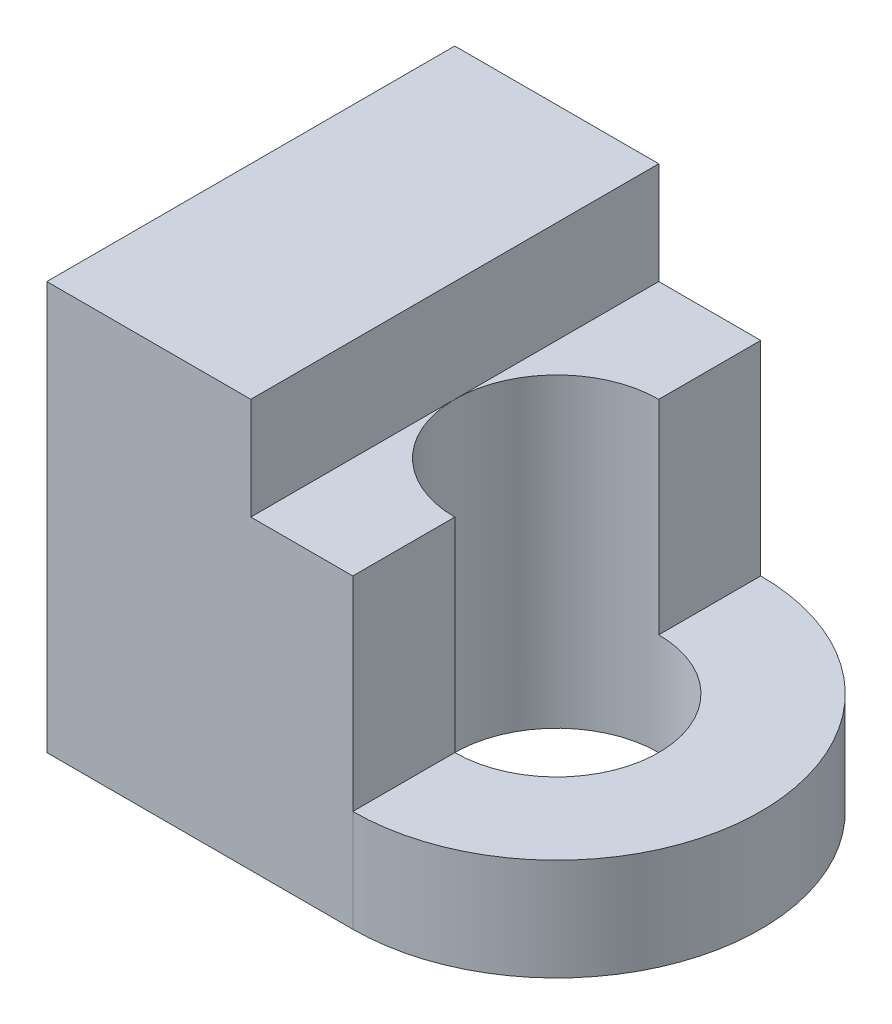
ISO-10303-21;
HEADER;
FILE_DESCRIPTION(('STEP AP214'),'2;1');
FILE_NAME('part.step','',(''),(''),'','','');
FILE_SCHEMA(('AUTOMOTIVE_DESIGN { 1 0 10303 214 1 1 1 1 }'));
ENDSEC;
DATA;
#1=APPLICATION_CONTEXT('core data for automotive mechanical design processes');
#2=APPLICATION_PROTOCOL_DEFINITION('international standard','automotive_design',2000,#1);
#3=PRODUCT_CONTEXT('',#1,'mechanical');
#4=PRODUCT('Part','Part','',(#3));
#5=PRODUCT_RELATED_PRODUCT_CATEGORY('part','',(#4));
#6=PRODUCT_DEFINITION_FORMATION('','',#4);
#7=PRODUCT_DEFINITION_CONTEXT('part definition',#1,'design');
#8=PRODUCT_DEFINITION('design','',#6,#7);
#9=PRODUCT_DEFINITION_SHAPE('','',#8);
#10=(LENGTH_UNIT() NAMED_UNIT(*) SI_UNIT(.MILLI.,.METRE.));
#11=(NAMED_UNIT(*) PLANE_ANGLE_UNIT() SI_UNIT($,.RADIAN.));
#12=(NAMED_UNIT(*) SI_UNIT($,.STERADIAN.) SOLID_ANGLE_UNIT());
#13=UNCERTAINTY_MEASURE_WITH_UNIT(LENGTH_MEASURE(1.E-05),#10,'distance_accuracy_value','');
#14=(GEOMETRIC_REPRESENTATION_CONTEXT(3) GLOBAL_UNCERTAINTY_ASSIGNED_CONTEXT((#13)) GLOBAL_UNIT_ASSIGNED_CONTEXT((#10,
#11,#12)) REPRESENTATION_CONTEXT('',''));
#15=CARTESIAN_POINT('',(0.,0.,0.));
#16=DIRECTION('',(0.,0.,1.));
#17=DIRECTION('',(1.,0.,0.));
#18=AXIS2_PLACEMENT_3D('',#15,#16,#17);
#19=CARTESIAN_POINT('',(-5.75757575757576,10.0261464563287,0.));
#20=DIRECTION('',(0.,1.,0.));
#21=DIRECTION('',(0.,0.,1.));
#22=AXIS2_PLACEMENT_3D('',#19,#20,#21);
#23=PLANE('',#22);
#24=DIRECTION('',(-1.,0.,0.));
#25=VECTOR('',#24,1.);
#26=CARTESIAN_POINT('',(-5.75757575757576,10.0261464563287,-2.));
#27=LINE('',#26,#25);
#28=CARTESIAN_POINT('',(-5.75757575757576,10.0261464563287,-2.));
#29=VERTEX_POINT('',#28);
#30=CARTESIAN_POINT('',(-6.75757575757576,10.0261464563287,-2.));
#31=VERTEX_POINT('',#30);
#32=EDGE_CURVE('E74',#29,#31,#27,.T.);
#33=ORIENTED_EDGE('',*,*,#32,.T.);
#34=DIRECTION('',(0.,0.,1.));
#35=VECTOR('',#34,1.);
#36=CARTESIAN_POINT('',(-6.75757575757576,10.0261464563287,0.));
#37=LINE('',#36,#35);
#38=CARTESIAN_POINT('',(-6.75757575757576,10.0261464563287,0.));
#39=VERTEX_POINT('',#38);
#40=EDGE_CURVE('E12',#31,#39,#37,.T.);
#41=ORIENTED_EDGE('',*,*,#40,.T.);
#42=CARTESIAN_POINT('',(-5.75757575757576,10.0261464563287,0.));
#43=DIRECTION('',(0.,1.,0.));
#44=DIRECTION('',(0.,0.,1.));
#45=AXIS2_PLACEMENT_3D('',#42,#43,#44);
#46=CIRCLE('',#45,1.);
#47=CARTESIAN_POINT('',(-5.75757575757576,10.0261464563287,-1.));
#48=VERTEX_POINT('',#47);
#49=EDGE_CURVE('E161',#48,#39,#46,.T.);
#50=ORIENTED_EDGE('',*,*,#49,.F.);
#51=DIRECTION('',(0.,0.,-1.));
#52=VECTOR('',#51,1.);
#53=CARTESIAN_POINT('',(-5.75757575757576,10.0261464563287,0.));
#54=LINE('',#53,#52);
#55=EDGE_CURVE('E164',#48,#29,#54,.T.);
#56=ORIENTED_EDGE('',*,*,#55,.T.);
#57=EDGE_LOOP('',(#33,#41,#50,#56));
#58=FACE_BOUND('',#57,.T.);
#59=ADVANCED_FACE('F53',(#58),#23,.T.);
#60=CARTESIAN_POINT('',(-5.75757575757576,10.0261464563287,1.));
#61=VERTEX_POINT('',#60);
#62=EDGE_CURVE('E160',#39,#61,#46,.T.);
#63=ORIENTED_EDGE('',*,*,#62,.F.);
#64=CARTESIAN_POINT('',(-6.75757575757576,10.0261464563287,2.));
#65=VERTEX_POINT('',#64);
#66=EDGE_CURVE('E57',#39,#65,#37,.T.);
#67=ORIENTED_EDGE('',*,*,#66,.T.);
#68=DIRECTION('',(-1.,0.,0.));
#69=VECTOR('',#68,1.);
#70=CARTESIAN_POINT('',(-5.75757575757576,10.0261464563287,2.));
#71=LINE('',#70,#69);
#72=CARTESIAN_POINT('',(-5.75757575757576,10.0261464563287,2.));
#73=VERTEX_POINT('',#72);
#74=EDGE_CURVE('E167',#73,#65,#71,.T.);
#75=ORIENTED_EDGE('',*,*,#74,.F.);
#76=DIRECTION('',(0.,0.,1.));
#77=VECTOR('',#76,1.);
#78=CARTESIAN_POINT('',(-5.75757575757576,10.0261464563287,0.));
#79=LINE('',#78,#77);
#80=EDGE_CURVE('E169',#61,#73,#79,.T.);
#81=ORIENTED_EDGE('',*,*,#80,.F.);
#82=EDGE_LOOP('',(#63,#67,#75,#81));
#83=FACE_BOUND('',#82,.T.);
#84=ADVANCED_FACE('F224',(#83),#23,.T.);
#85=CARTESIAN_POINT('',(-5.75757575757576,8.02614645632867,0.));
#86=DIRECTION('',(0.,1.,0.));
#87=DIRECTION('',(0.,0.,1.));
#88=AXIS2_PLACEMENT_3D('',#85,#86,#87);
#89=PLANE('',#88);
#90=CARTESIAN_POINT('',(-5.75757575757576,8.02614645632867,0.));
#91=DIRECTION('',(0.,1.,0.));
#92=DIRECTION('',(0.,0.,1.));
#93=AXIS2_PLACEMENT_3D('',#90,#91,#92);
#94=CIRCLE('',#93,2.);
#95=CARTESIAN_POINT('',(-5.75757575757576,8.02614645632867,2.));
#96=VERTEX_POINT('',#95);
#97=CARTESIAN_POINT('',(-5.75757575757576,8.02614645632867,-2.));
#98=VERTEX_POINT('',#97);
#99=EDGE_CURVE('E139',#96,#98,#94,.T.);
#100=ORIENTED_EDGE('',*,*,#99,.T.);
#101=DIRECTION('',(0.,0.,1.));
#102=VECTOR('',#101,1.);
#103=CARTESIAN_POINT('',(-5.75757575757576,8.02614645632867,0.));
#104=LINE('',#103,#102);
#105=CARTESIAN_POINT('',(-5.75757575757576,8.02614645632867,-1.));
#106=VERTEX_POINT('',#105);
#107=EDGE_CURVE('E187',#98,#106,#104,.T.);
#108=ORIENTED_EDGE('',*,*,#107,.T.);
#109=CARTESIAN_POINT('',(-5.75757575757576,8.02614645632867,0.));
#110=DIRECTION('',(0.,1.,0.));
#111=DIRECTION('',(0.,0.,1.));
#112=AXIS2_PLACEMENT_3D('',#109,#110,#111);
#113=CIRCLE('',#112,1.);
#114=CARTESIAN_POINT('',(-5.75757575757576,8.02614645632867,1.));
#115=VERTEX_POINT('',#114);
#116=EDGE_CURVE('E190',#115,#106,#113,.T.);
#117=ORIENTED_EDGE('',*,*,#116,.F.);
#118=DIRECTION('',(0.,0.,-1.));
#119=VECTOR('',#118,1.);
#120=CARTESIAN_POINT('',(-5.75757575757576,8.02614645632867,0.));
#121=LINE('',#120,#119);
#122=EDGE_CURVE('E184',#96,#115,#121,.T.);
#123=ORIENTED_EDGE('',*,*,#122,.F.);
#124=EDGE_LOOP('',(#100,#108,#117,#123));
#125=FACE_BOUND('',#124,.T.);
#126=ADVANCED_FACE('F242',(#125),#89,.T.);
#127=CARTESIAN_POINT('',(-5.75757575757576,7.02614645632867,0.));
#128=DIRECTION('',(0.,1.,0.));
#129=DIRECTION('',(0.,0.,1.));
#130=AXIS2_PLACEMENT_3D('',#127,#128,#129);
#131=PLANE('',#130);
#132=CARTESIAN_POINT('',(-5.75757575757576,7.02614645632867,0.));
#133=DIRECTION('',(0.,1.,0.));
#134=DIRECTION('',(0.,0.,1.));
#135=AXIS2_PLACEMENT_3D('',#132,#133,#134);
#136=CIRCLE('',#135,1.);
#137=CARTESIAN_POINT('',(-5.75757575757576,7.02614645632867,1.));
#138=VERTEX_POINT('',#137);
#139=EDGE_CURVE('E189',#138,#138,#136,.T.);
#140=ORIENTED_EDGE('',*,*,#139,.T.);
#141=EDGE_LOOP('',(#140));
#142=FACE_BOUND('',#141,.T.);
#143=DIRECTION('',(0.,0.,-1.));
#144=VECTOR('',#143,1.);
#145=CARTESIAN_POINT('',(-8.75757575757576,7.02614645632867,2.));
#146=LINE('',#145,#144);
#147=CARTESIAN_POINT('',(-8.75757575757576,7.02614645632867,2.));
#148=VERTEX_POINT('',#147);
#149=CARTESIAN_POINT('',(-8.75757575757576,7.02614645632867,-2.));
#150=VERTEX_POINT('',#149);
#151=EDGE_CURVE('E134',#148,#150,#146,.T.);
#152=ORIENTED_EDGE('',*,*,#151,.T.);
#153=DIRECTION('',(-1.,0.,0.));
#154=VECTOR('',#153,1.);
#155=CARTESIAN_POINT('',(-5.75757575757576,7.02614645632867,-2.));
#156=LINE('',#155,#154);
#157=CARTESIAN_POINT('',(-5.75757575757576,7.02614645632867,-2.));
#158=VERTEX_POINT('',#157);
#159=EDGE_CURVE('E200',#158,#150,#156,.T.);
#160=ORIENTED_EDGE('',*,*,#159,.F.);
#161=CARTESIAN_POINT('',(-5.75757575757576,7.02614645632867,0.));
#162=DIRECTION('',(0.,1.,0.));
#163=DIRECTION('',(0.,0.,1.));
#164=AXIS2_PLACEMENT_3D('',#161,#162,#163);
#165=CIRCLE('',#164,2.);
#166=CARTESIAN_POINT('',(-5.75757575757576,7.02614645632867,2.));
#167=VERTEX_POINT('',#166);
#168=EDGE_CURVE('E197',#167,#158,#165,.T.);
#169=ORIENTED_EDGE('',*,*,#168,.F.);
#170=DIRECTION('',(-1.,0.,0.));
#171=VECTOR('',#170,1.);
#172=CARTESIAN_POINT('',(-5.75757575757576,7.02614645632867,2.));
#173=LINE('',#172,#171);
#174=EDGE_CURVE('E193',#167,#148,#173,.T.);
#175=ORIENTED_EDGE('',*,*,#174,.T.);
#176=EDGE_LOOP('',(#152,#160,#169,#175));
#177=FACE_BOUND('',#176,.T.);
#178=ADVANCED_FACE('F211',(#142,#177),#131,.F.);
#179=CARTESIAN_POINT('',(-5.75757575757576,8.02614645632867,2.));
#180=DIRECTION('',(0.,0.,1.));
#181=DIRECTION('',(1.,0.,0.));
#182=AXIS2_PLACEMENT_3D('',#179,#180,#181);
#183=PLANE('',#182);
#184=DIRECTION('',(0.,-1.,0.));
#185=VECTOR('',#184,1.);
#186=CARTESIAN_POINT('',(-8.75757575757576,8.02614645632867,2.));
#187=LINE('',#186,#185);
#188=CARTESIAN_POINT('',(-8.75757575757576,11.0261464563287,2.));
#189=VERTEX_POINT('',#188);
#190=EDGE_CURVE('E128',#189,#148,#187,.T.);
#191=ORIENTED_EDGE('',*,*,#190,.T.);
#192=ORIENTED_EDGE('',*,*,#174,.F.);
#193=DIRECTION('',(0.,-1.,0.));
#194=VECTOR('',#193,1.);
#195=CARTESIAN_POINT('',(-5.75757575757576,8.02614645632867,2.));
#196=LINE('',#195,#194);
#197=EDGE_CURVE('E203',#96,#167,#196,.T.);
#198=ORIENTED_EDGE('',*,*,#197,.F.);
#199=DIRECTION('',(0.,-1.,0.));
#200=VECTOR('',#199,1.);
#201=CARTESIAN_POINT('',(-5.75757575757576,10.0261464563287,2.));
#202=LINE('',#201,#200);
#203=EDGE_CURVE('E175',#73,#96,#202,.T.);
#204=ORIENTED_EDGE('',*,*,#203,.F.);
#205=ORIENTED_EDGE('',*,*,#74,.T.);
#206=DIRECTION('',(0.,-1.,0.));
#207=VECTOR('',#206,1.);
#208=CARTESIAN_POINT('',(-6.75757575757576,11.0261464563287,2.));
#209=LINE('',#208,#207);
#210=CARTESIAN_POINT('',(-6.75757575757576,11.0261464563287,2.));
#211=VERTEX_POINT('',#210);
#212=EDGE_CURVE('E149',#211,#65,#209,.T.);
#213=ORIENTED_EDGE('',*,*,#212,.F.);
#214=DIRECTION('',(-1.,0.,0.));
#215=VECTOR('',#214,1.);
#216=CARTESIAN_POINT('',(-5.75757575757576,11.0261464563287,2.));
#217=LINE('',#216,#215);
#218=EDGE_CURVE('E144',#211,#189,#217,.T.);
#219=ORIENTED_EDGE('',*,*,#218,.T.);
#220=EDGE_LOOP('',(#191,#192,#198,#204,#205,#213,#219));
#221=FACE_BOUND('',#220,.T.);
#222=ADVANCED_FACE('F55',(#221),#183,.T.);
#223=CARTESIAN_POINT('',(-5.75757575757576,8.02614645632867,0.));
#224=DIRECTION('',(0.,-1.,0.));
#225=DIRECTION('',(0.,0.,-1.));
#226=AXIS2_PLACEMENT_3D('',#223,#224,#225);
#227=CYLINDRICAL_SURFACE('',#226,2.);
#228=ORIENTED_EDGE('',*,*,#168,.T.);
#229=DIRECTION('',(0.,-1.,0.));
#230=VECTOR('',#229,1.);
#231=CARTESIAN_POINT('',(-5.75757575757576,8.02614645632867,-2.));
#232=LINE('',#231,#230);
#233=EDGE_CURVE('E205',#98,#158,#232,.T.);
#234=ORIENTED_EDGE('',*,*,#233,.F.);
#235=ORIENTED_EDGE('',*,*,#99,.F.);
#236=ORIENTED_EDGE('',*,*,#197,.T.);
#237=EDGE_LOOP('',(#228,#234,#235,#236));
#238=FACE_BOUND('',#237,.T.);
#239=ADVANCED_FACE('F217',(#238),#227,.T.);
#240=CARTESIAN_POINT('',(-5.75757575757576,8.02614645632867,-2.));
#241=DIRECTION('',(0.,0.,1.));
#242=DIRECTION('',(1.,0.,0.));
#243=AXIS2_PLACEMENT_3D('',#240,#241,#242);
#244=PLANE('',#243);
#245=DIRECTION('',(0.,-1.,0.));
#246=VECTOR('',#245,1.);
#247=CARTESIAN_POINT('',(-8.75757575757576,8.02614645632867,-2.));
#248=LINE('',#247,#246);
#249=CARTESIAN_POINT('',(-8.75757575757576,11.0261464563287,-2.));
#250=VERTEX_POINT('',#249);
#251=EDGE_CURVE('E138',#250,#150,#248,.T.);
#252=ORIENTED_EDGE('',*,*,#251,.F.);
#253=DIRECTION('',(-1.,0.,0.));
#254=VECTOR('',#253,1.);
#255=CARTESIAN_POINT('',(-5.75757575757576,11.0261464563287,-2.));
#256=LINE('',#255,#254);
#257=CARTESIAN_POINT('',(-6.75757575757576,11.0261464563287,-2.));
#258=VERTEX_POINT('',#257);
#259=EDGE_CURVE('E146',#258,#250,#256,.T.);
#260=ORIENTED_EDGE('',*,*,#259,.F.);
#261=DIRECTION('',(0.,-1.,0.));
#262=VECTOR('',#261,1.);
#263=CARTESIAN_POINT('',(-6.75757575757576,11.0261464563287,-2.));
#264=LINE('',#263,#262);
#265=EDGE_CURVE('E156',#258,#31,#264,.T.);
#266=ORIENTED_EDGE('',*,*,#265,.T.);
#267=ORIENTED_EDGE('',*,*,#32,.F.);
#268=DIRECTION('',(0.,-1.,0.));
#269=VECTOR('',#268,1.);
#270=CARTESIAN_POINT('',(-5.75757575757576,10.0261464563287,-2.));
#271=LINE('',#270,#269);
#272=EDGE_CURVE('E178',#29,#98,#271,.T.);
#273=ORIENTED_EDGE('',*,*,#272,.T.);
#274=ORIENTED_EDGE('',*,*,#233,.T.);
#275=ORIENTED_EDGE('',*,*,#159,.T.);
#276=EDGE_LOOP('',(#252,#260,#266,#267,#273,#274,#275));
#277=FACE_BOUND('',#276,.T.);
#278=ADVANCED_FACE('F228',(#277),#244,.F.);
#279=CARTESIAN_POINT('',(-8.75757575757576,8.02614645632867,2.));
#280=DIRECTION('',(-1.,0.,0.));
#281=DIRECTION('',(0.,0.,1.));
#282=AXIS2_PLACEMENT_3D('',#279,#280,#281);
#283=PLANE('',#282);
#284=ORIENTED_EDGE('',*,*,#151,.F.);
#285=ORIENTED_EDGE('',*,*,#190,.F.);
#286=DIRECTION('',(0.,0.,-1.));
#287=VECTOR('',#286,1.);
#288=CARTESIAN_POINT('',(-8.75757575757576,11.0261464563287,0.));
#289=LINE('',#288,#287);
#290=EDGE_CURVE('E132',#189,#250,#289,.T.);
#291=ORIENTED_EDGE('',*,*,#290,.T.);
#292=ORIENTED_EDGE('',*,*,#251,.T.);
#293=EDGE_LOOP('',(#284,#285,#291,#292));
#294=FACE_BOUND('',#293,.T.);
#295=ADVANCED_FACE('F130',(#294),#283,.T.);
#296=CARTESIAN_POINT('',(-5.75757575757576,8.02614645632867,0.));
#297=DIRECTION('',(0.,-1.,0.));
#298=DIRECTION('',(0.,0.,-1.));
#299=AXIS2_PLACEMENT_3D('',#296,#297,#298);
#300=CYLINDRICAL_SURFACE('',#299,1.);
#301=ORIENTED_EDGE('',*,*,#139,.F.);
#302=EDGE_LOOP('',(#301));
#303=FACE_BOUND('',#302,.T.);
#304=ORIENTED_EDGE('',*,*,#116,.T.);
#305=DIRECTION('',(0.,-1.,0.));
#306=VECTOR('',#305,1.);
#307=CARTESIAN_POINT('',(-5.75757575757576,10.0261464563287,-1.));
#308=LINE('',#307,#306);
#309=EDGE_CURVE('E181',#48,#106,#308,.T.);
#310=ORIENTED_EDGE('',*,*,#309,.F.);
#311=ORIENTED_EDGE('',*,*,#49,.T.);
#312=ORIENTED_EDGE('',*,*,#62,.T.);
#313=DIRECTION('',(0.,-1.,0.));
#314=VECTOR('',#313,1.);
#315=CARTESIAN_POINT('',(-5.75757575757576,10.0261464563287,1.));
#316=LINE('',#315,#314);
#317=EDGE_CURVE('E172',#61,#115,#316,.T.);
#318=ORIENTED_EDGE('',*,*,#317,.T.);
#319=EDGE_LOOP('',(#304,#310,#311,#312,#318));
#320=FACE_BOUND('',#319,.T.);
#321=ADVANCED_FACE('F235',(#303,#320),#300,.F.);
#322=CARTESIAN_POINT('',(-5.75757575757576,10.0261464563287,0.));
#323=DIRECTION('',(-1.,0.,0.));
#324=DIRECTION('',(0.,0.,1.));
#325=AXIS2_PLACEMENT_3D('',#322,#323,#324);
#326=PLANE('',#325);
#327=ORIENTED_EDGE('',*,*,#107,.F.);
#328=ORIENTED_EDGE('',*,*,#272,.F.);
#329=ORIENTED_EDGE('',*,*,#55,.F.);
#330=ORIENTED_EDGE('',*,*,#309,.T.);
#331=EDGE_LOOP('',(#327,#328,#329,#330));
#332=FACE_BOUND('',#331,.T.);
#333=ADVANCED_FACE('F248',(#332),#326,.F.);
#334=CARTESIAN_POINT('',(-5.75757575757576,10.0261464563287,0.));
#335=DIRECTION('',(1.,0.,0.));
#336=DIRECTION('',(0.,0.,-1.));
#337=AXIS2_PLACEMENT_3D('',#334,#335,#336);
#338=PLANE('',#337);
#339=ORIENTED_EDGE('',*,*,#203,.T.);
#340=ORIENTED_EDGE('',*,*,#122,.T.);
#341=ORIENTED_EDGE('',*,*,#317,.F.);
#342=ORIENTED_EDGE('',*,*,#80,.T.);
#343=EDGE_LOOP('',(#339,#340,#341,#342));
#344=FACE_BOUND('',#343,.T.);
#345=ADVANCED_FACE('F221',(#344),#338,.T.);
#346=CARTESIAN_POINT('',(-6.75757575757576,11.0261464563287,0.));
#347=DIRECTION('',(-1.,0.,0.));
#348=DIRECTION('',(0.,0.,1.));
#349=AXIS2_PLACEMENT_3D('',#346,#347,#348);
#350=PLANE('',#349);
#351=ORIENTED_EDGE('',*,*,#40,.F.);
#352=ORIENTED_EDGE('',*,*,#265,.F.);
#353=DIRECTION('',(0.,0.,-1.));
#354=VECTOR('',#353,1.);
#355=CARTESIAN_POINT('',(-6.75757575757576,11.0261464563287,0.));
#356=LINE('',#355,#354);
#357=EDGE_CURVE('E151',#211,#258,#356,.T.);
#358=ORIENTED_EDGE('',*,*,#357,.F.);
#359=ORIENTED_EDGE('',*,*,#212,.T.);
#360=ORIENTED_EDGE('',*,*,#66,.F.);
#361=EDGE_LOOP('',(#351,#352,#358,#359,#360));
#362=FACE_BOUND('',#361,.T.);
#363=ADVANCED_FACE('F226',(#362),#350,.F.);
#364=CARTESIAN_POINT('',(-5.75757575757576,11.0261464563287,0.));
#365=DIRECTION('',(0.,1.,0.));
#366=DIRECTION('',(0.,0.,1.));
#367=AXIS2_PLACEMENT_3D('',#364,#365,#366);
#368=PLANE('',#367);
#369=ORIENTED_EDGE('',*,*,#290,.F.);
#370=ORIENTED_EDGE('',*,*,#218,.F.);
#371=ORIENTED_EDGE('',*,*,#357,.T.);
#372=ORIENTED_EDGE('',*,*,#259,.T.);
#373=EDGE_LOOP('',(#369,#370,#371,#372));
#374=FACE_BOUND('',#373,.T.);
#375=ADVANCED_FACE('F143',(#374),#368,.T.);
#376=CLOSED_SHELL('',(#59,#84,#126,#178,#222,#239,#278,#295,#321,#333,#345,#363,#375));
#377=MANIFOLD_SOLID_BREP('B2',#376);
#378=ADVANCED_BREP_SHAPE_REPRESENTATION('',(#18,#377),#14);
#379=SHAPE_DEFINITION_REPRESENTATION(#9,#378);
ENDSEC;
END-ISO-10303-21;
